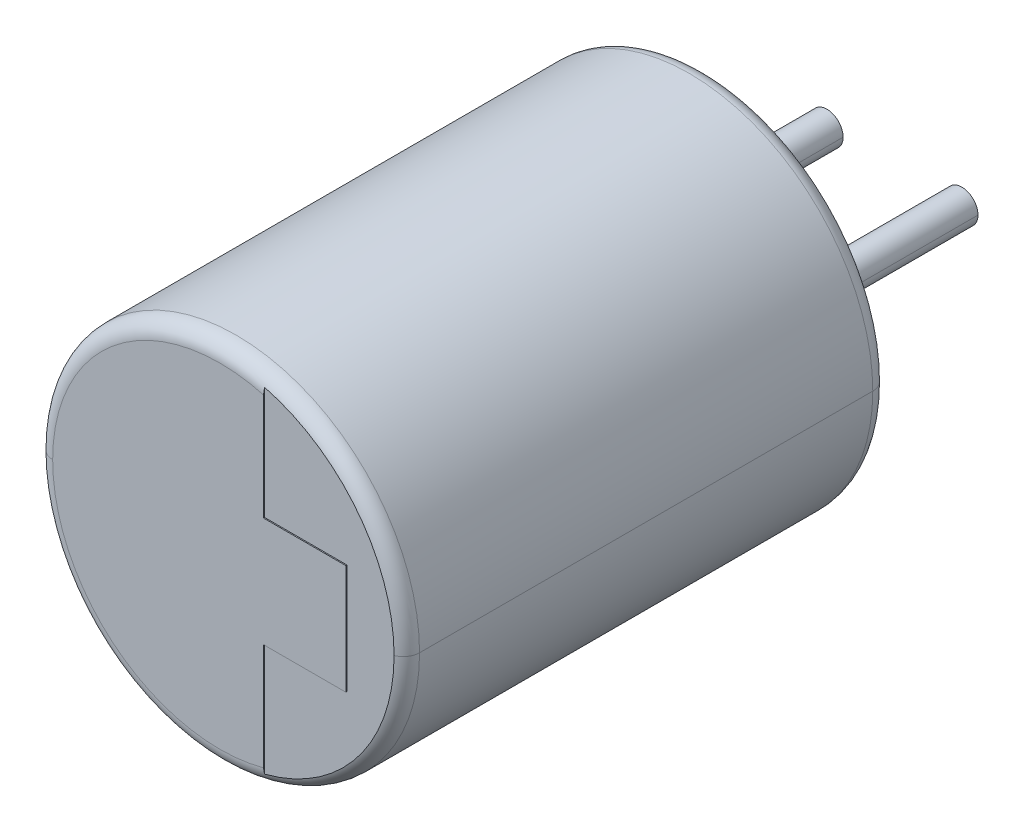
ISO-10303-21;
HEADER;
FILE_DESCRIPTION(('STEP AP214'),'2;1');
FILE_NAME('part.step','',(''),(''),'','','');
FILE_SCHEMA(('AUTOMOTIVE_DESIGN { 1 0 10303 214 1 1 1 1 }'));
ENDSEC;
DATA;
#1=APPLICATION_CONTEXT('core data for automotive mechanical design processes');
#2=APPLICATION_PROTOCOL_DEFINITION('international standard','automotive_design',2000,#1);
#3=PRODUCT_CONTEXT('',#1,'mechanical');
#4=PRODUCT('Part','Part','',(#3));
#5=PRODUCT_RELATED_PRODUCT_CATEGORY('part','',(#4));
#6=PRODUCT_DEFINITION_FORMATION('','',#4);
#7=PRODUCT_DEFINITION_CONTEXT('part definition',#1,'design');
#8=PRODUCT_DEFINITION('design','',#6,#7);
#9=PRODUCT_DEFINITION_SHAPE('','',#8);
#10=(LENGTH_UNIT() NAMED_UNIT(*) SI_UNIT(.MILLI.,.METRE.));
#11=(NAMED_UNIT(*) PLANE_ANGLE_UNIT() SI_UNIT($,.RADIAN.));
#12=(NAMED_UNIT(*) SI_UNIT($,.STERADIAN.) SOLID_ANGLE_UNIT());
#13=UNCERTAINTY_MEASURE_WITH_UNIT(LENGTH_MEASURE(1.E-05),#10,'distance_accuracy_value','');
#14=(GEOMETRIC_REPRESENTATION_CONTEXT(3) GLOBAL_UNCERTAINTY_ASSIGNED_CONTEXT((#13)) GLOBAL_UNIT_ASSIGNED_CONTEXT((#10,
#11,#12)) REPRESENTATION_CONTEXT('',''));
#15=CARTESIAN_POINT('',(0.,0.,0.));
#16=DIRECTION('',(0.,0.,1.));
#17=DIRECTION('',(1.,0.,0.));
#18=AXIS2_PLACEMENT_3D('',#15,#16,#17);
#19=CARTESIAN_POINT('',(1.25,0.,0.));
#20=DIRECTION('',(0.,0.,1.));
#21=DIRECTION('',(1.,0.,0.));
#22=AXIS2_PLACEMENT_3D('',#19,#20,#21);
#23=CYLINDRICAL_SURFACE('',#22,0.3);
#24=DIRECTION('',(0.,0.,-1.));
#25=VECTOR('',#24,1.);
#26=CARTESIAN_POINT('',(0.95,0.,0.));
#27=LINE('',#26,#25);
#28=CARTESIAN_POINT('',(0.95,0.,0.));
#29=VERTEX_POINT('',#28);
#30=CARTESIAN_POINT('',(0.95,0.,-3.5));
#31=VERTEX_POINT('',#30);
#32=EDGE_CURVE('E11',#29,#31,#27,.T.);
#33=ORIENTED_EDGE('',*,*,#32,.T.);
#34=CARTESIAN_POINT('',(1.25,0.,-3.5));
#35=DIRECTION('',(0.,0.,1.));
#36=DIRECTION('',(-1.,0.,0.));
#37=AXIS2_PLACEMENT_3D('',#34,#35,#36);
#38=CIRCLE('',#37,0.3);
#39=CARTESIAN_POINT('',(1.55,0.,-3.5));
#40=VERTEX_POINT('',#39);
#41=EDGE_CURVE('E208',#31,#40,#38,.T.);
#42=ORIENTED_EDGE('',*,*,#41,.T.);
#43=DIRECTION('',(0.,0.,-1.));
#44=VECTOR('',#43,1.);
#45=CARTESIAN_POINT('',(1.55,0.,0.));
#46=LINE('',#45,#44);
#47=CARTESIAN_POINT('',(1.55,0.,0.));
#48=VERTEX_POINT('',#47);
#49=EDGE_CURVE('E29',#48,#40,#46,.T.);
#50=ORIENTED_EDGE('',*,*,#49,.F.);
#51=CARTESIAN_POINT('',(1.25,0.,0.));
#52=DIRECTION('',(0.,0.,1.));
#53=DIRECTION('',(-1.,0.,0.));
#54=AXIS2_PLACEMENT_3D('',#51,#52,#53);
#55=CIRCLE('',#54,0.3);
#56=EDGE_CURVE('E179',#29,#48,#55,.T.);
#57=ORIENTED_EDGE('',*,*,#56,.F.);
#58=EDGE_LOOP('',(#33,#42,#50,#57));
#59=FACE_BOUND('',#58,.T.);
#60=ADVANCED_FACE('F18',(#59),#23,.T.);
#61=CARTESIAN_POINT('',(1.25,0.,0.));
#62=DIRECTION('',(0.,0.,1.));
#63=DIRECTION('',(1.,0.,0.));
#64=AXIS2_PLACEMENT_3D('',#61,#62,#63);
#65=CYLINDRICAL_SURFACE('',#64,0.3);
#66=ORIENTED_EDGE('',*,*,#49,.T.);
#67=CARTESIAN_POINT('',(1.25,0.,-3.5));
#68=DIRECTION('',(0.,0.,1.));
#69=DIRECTION('',(1.,0.,0.));
#70=AXIS2_PLACEMENT_3D('',#67,#68,#69);
#71=CIRCLE('',#70,0.3);
#72=EDGE_CURVE('E215',#40,#31,#71,.T.);
#73=ORIENTED_EDGE('',*,*,#72,.T.);
#74=ORIENTED_EDGE('',*,*,#32,.F.);
#75=CARTESIAN_POINT('',(1.25,0.,0.));
#76=DIRECTION('',(0.,0.,1.));
#77=DIRECTION('',(1.,0.,0.));
#78=AXIS2_PLACEMENT_3D('',#75,#76,#77);
#79=CIRCLE('',#78,0.3);
#80=EDGE_CURVE('E170',#48,#29,#79,.T.);
#81=ORIENTED_EDGE('',*,*,#80,.F.);
#82=EDGE_LOOP('',(#66,#73,#74,#81));
#83=FACE_BOUND('',#82,.T.);
#84=ADVANCED_FACE('F764',(#83),#65,.T.);
#85=CARTESIAN_POINT('',(0.,0.,-3.5));
#86=DIRECTION('',(0.,0.,1.));
#87=DIRECTION('',(1.,0.,0.));
#88=AXIS2_PLACEMENT_3D('',#85,#86,#87);
#89=PLANE('',#88);
#90=ORIENTED_EDGE('',*,*,#41,.F.);
#91=ORIENTED_EDGE('',*,*,#72,.F.);
#92=EDGE_LOOP('',(#90,#91));
#93=FACE_BOUND('',#92,.T.);
#94=ADVANCED_FACE('F778',(#93),#89,.F.);
#95=CARTESIAN_POINT('',(0.,0.,-3.5));
#96=DIRECTION('',(0.,0.,1.));
#97=DIRECTION('',(1.,0.,0.));
#98=AXIS2_PLACEMENT_3D('',#95,#96,#97);
#99=PLANE('',#98);
#100=CARTESIAN_POINT('',(-1.25,0.,-3.5));
#101=DIRECTION('',(0.,0.,1.));
#102=DIRECTION('',(-1.,0.,0.));
#103=AXIS2_PLACEMENT_3D('',#100,#101,#102);
#104=CIRCLE('',#103,0.3);
#105=CARTESIAN_POINT('',(-1.55,0.,-3.5));
#106=VERTEX_POINT('',#105);
#107=CARTESIAN_POINT('',(-0.95,0.,-3.5));
#108=VERTEX_POINT('',#107);
#109=EDGE_CURVE('E204',#106,#108,#104,.T.);
#110=ORIENTED_EDGE('',*,*,#109,.F.);
#111=CARTESIAN_POINT('',(-1.25,0.,-3.5));
#112=DIRECTION('',(0.,0.,1.));
#113=DIRECTION('',(1.,0.,0.));
#114=AXIS2_PLACEMENT_3D('',#111,#112,#113);
#115=CIRCLE('',#114,0.3);
#116=EDGE_CURVE('E195',#108,#106,#115,.T.);
#117=ORIENTED_EDGE('',*,*,#116,.F.);
#118=EDGE_LOOP('',(#110,#117));
#119=FACE_BOUND('',#118,.T.);
#120=ADVANCED_FACE('F789',(#119),#99,.F.);
#121=CARTESIAN_POINT('',(-1.25,0.,0.));
#122=DIRECTION('',(0.,0.,1.));
#123=DIRECTION('',(1.,0.,0.));
#124=AXIS2_PLACEMENT_3D('',#121,#122,#123);
#125=CYLINDRICAL_SURFACE('',#124,0.3);
#126=DIRECTION('',(0.,0.,-1.));
#127=VECTOR('',#126,1.);
#128=CARTESIAN_POINT('',(-1.55,0.,0.));
#129=LINE('',#128,#127);
#130=CARTESIAN_POINT('',(-1.55,0.,0.));
#131=VERTEX_POINT('',#130);
#132=EDGE_CURVE('E199',#131,#106,#129,.T.);
#133=ORIENTED_EDGE('',*,*,#132,.T.);
#134=ORIENTED_EDGE('',*,*,#109,.T.);
#135=DIRECTION('',(0.,0.,-1.));
#136=VECTOR('',#135,1.);
#137=CARTESIAN_POINT('',(-0.95,0.,0.));
#138=LINE('',#137,#136);
#139=CARTESIAN_POINT('',(-0.95,0.,0.));
#140=VERTEX_POINT('',#139);
#141=EDGE_CURVE('E200',#140,#108,#138,.T.);
#142=ORIENTED_EDGE('',*,*,#141,.F.);
#143=CARTESIAN_POINT('',(-1.25,0.,0.));
#144=DIRECTION('',(0.,0.,1.));
#145=DIRECTION('',(-1.,0.,0.));
#146=AXIS2_PLACEMENT_3D('',#143,#144,#145);
#147=CIRCLE('',#146,0.3);
#148=EDGE_CURVE('E279',#131,#140,#147,.T.);
#149=ORIENTED_EDGE('',*,*,#148,.F.);
#150=EDGE_LOOP('',(#133,#134,#142,#149));
#151=FACE_BOUND('',#150,.T.);
#152=ADVANCED_FACE('F801',(#151),#125,.T.);
#153=CARTESIAN_POINT('',(-1.25,0.,0.));
#154=DIRECTION('',(0.,0.,1.));
#155=DIRECTION('',(1.,0.,0.));
#156=AXIS2_PLACEMENT_3D('',#153,#154,#155);
#157=CYLINDRICAL_SURFACE('',#156,0.3);
#158=ORIENTED_EDGE('',*,*,#141,.T.);
#159=ORIENTED_EDGE('',*,*,#116,.T.);
#160=ORIENTED_EDGE('',*,*,#132,.F.);
#161=CARTESIAN_POINT('',(-1.25,0.,0.));
#162=DIRECTION('',(0.,0.,1.));
#163=DIRECTION('',(1.,0.,0.));
#164=AXIS2_PLACEMENT_3D('',#161,#162,#163);
#165=CIRCLE('',#164,0.3);
#166=EDGE_CURVE('E282',#140,#131,#165,.T.);
#167=ORIENTED_EDGE('',*,*,#166,.F.);
#168=EDGE_LOOP('',(#158,#159,#160,#167));
#169=FACE_BOUND('',#168,.T.);
#170=ADVANCED_FACE('F813',(#169),#157,.T.);
#171=CARTESIAN_POINT('',(2.334429515751,-1.016,9.));
#172=DIRECTION('',(0.,1.,0.));
#173=DIRECTION('',(1.,0.,0.));
#174=AXIS2_PLACEMENT_3D('',#171,#172,#173);
#175=PLANE('',#174);
#176=DIRECTION('',(0.,0.,-1.));
#177=VECTOR('',#176,1.);
#178=CARTESIAN_POINT('',(0.8104295157508,-1.016,9.));
#179=LINE('',#178,#177);
#180=CARTESIAN_POINT('',(0.8104295157508,-1.016,9.));
#181=VERTEX_POINT('',#180);
#182=CARTESIAN_POINT('',(0.8104295157508,-1.016,8.98));
#183=VERTEX_POINT('',#182);
#184=EDGE_CURVE('E254',#181,#183,#179,.T.);
#185=ORIENTED_EDGE('',*,*,#184,.T.);
#186=DIRECTION('',(-1.,0.,0.));
#187=VECTOR('',#186,1.);
#188=CARTESIAN_POINT('',(2.334429515751,-1.016,8.98));
#189=LINE('',#188,#187);
#190=CARTESIAN_POINT('',(2.334429515751,-1.016,8.98));
#191=VERTEX_POINT('',#190);
#192=EDGE_CURVE('E193',#191,#183,#189,.T.);
#193=ORIENTED_EDGE('',*,*,#192,.F.);
#194=DIRECTION('',(0.,0.,-1.));
#195=VECTOR('',#194,1.);
#196=CARTESIAN_POINT('',(2.334429515751,-1.016,9.));
#197=LINE('',#196,#195);
#198=CARTESIAN_POINT('',(2.334429515751,-1.016,9.));
#199=VERTEX_POINT('',#198);
#200=EDGE_CURVE('E22',#199,#191,#197,.T.);
#201=ORIENTED_EDGE('',*,*,#200,.F.);
#202=DIRECTION('',(-1.,0.,0.));
#203=VECTOR('',#202,1.);
#204=CARTESIAN_POINT('',(2.334429515751,-1.016,9.));
#205=LINE('',#204,#203);
#206=EDGE_CURVE('E229',#199,#181,#205,.T.);
#207=ORIENTED_EDGE('',*,*,#206,.T.);
#208=EDGE_LOOP('',(#185,#193,#201,#207));
#209=FACE_BOUND('',#208,.T.);
#210=ADVANCED_FACE('F363',(#209),#175,.F.);
#211=CARTESIAN_POINT('',(2.334429515751,1.016,9.));
#212=DIRECTION('',(-1.,0.,0.));
#213=DIRECTION('',(0.,0.,1.));
#214=AXIS2_PLACEMENT_3D('',#211,#212,#213);
#215=PLANE('',#214);
#216=ORIENTED_EDGE('',*,*,#200,.T.);
#217=DIRECTION('',(0.,-1.,0.));
#218=VECTOR('',#217,1.);
#219=CARTESIAN_POINT('',(2.334429515751,1.016,8.98));
#220=LINE('',#219,#218);
#221=CARTESIAN_POINT('',(2.334429515751,1.016,8.98));
#222=VERTEX_POINT('',#221);
#223=EDGE_CURVE('E189',#222,#191,#220,.T.);
#224=ORIENTED_EDGE('',*,*,#223,.F.);
#225=DIRECTION('',(0.,0.,-1.));
#226=VECTOR('',#225,1.);
#227=CARTESIAN_POINT('',(2.334429515751,1.016,9.));
#228=LINE('',#227,#226);
#229=CARTESIAN_POINT('',(2.334429515751,1.016,9.));
#230=VERTEX_POINT('',#229);
#231=EDGE_CURVE('E278',#230,#222,#228,.T.);
#232=ORIENTED_EDGE('',*,*,#231,.F.);
#233=DIRECTION('',(0.,-1.,0.));
#234=VECTOR('',#233,1.);
#235=CARTESIAN_POINT('',(2.334429515751,1.016,9.));
#236=LINE('',#235,#234);
#237=EDGE_CURVE('E233',#230,#199,#236,.T.);
#238=ORIENTED_EDGE('',*,*,#237,.T.);
#239=EDGE_LOOP('',(#216,#224,#232,#238));
#240=FACE_BOUND('',#239,.T.);
#241=ADVANCED_FACE('F390',(#240),#215,.F.);
#242=CARTESIAN_POINT('',(0.8104295157508,1.016,9.));
#243=DIRECTION('',(0.,-1.,0.));
#244=DIRECTION('',(0.,0.,-1.));
#245=AXIS2_PLACEMENT_3D('',#242,#243,#244);
#246=PLANE('',#245);
#247=ORIENTED_EDGE('',*,*,#231,.T.);
#248=DIRECTION('',(1.,0.,0.));
#249=VECTOR('',#248,1.);
#250=CARTESIAN_POINT('',(0.8104295157508,1.016,8.98));
#251=LINE('',#250,#249);
#252=CARTESIAN_POINT('',(0.8104295157508,1.016,8.98));
#253=VERTEX_POINT('',#252);
#254=EDGE_CURVE('E194',#253,#222,#251,.T.);
#255=ORIENTED_EDGE('',*,*,#254,.F.);
#256=DIRECTION('',(0.,0.,-1.));
#257=VECTOR('',#256,1.);
#258=CARTESIAN_POINT('',(0.8104295157508,1.016,9.));
#259=LINE('',#258,#257);
#260=CARTESIAN_POINT('',(0.8104295157508,1.016,9.));
#261=VERTEX_POINT('',#260);
#262=EDGE_CURVE('E242',#261,#253,#259,.T.);
#263=ORIENTED_EDGE('',*,*,#262,.F.);
#264=DIRECTION('',(1.,0.,0.));
#265=VECTOR('',#264,1.);
#266=CARTESIAN_POINT('',(0.8104295157508,1.016,9.));
#267=LINE('',#266,#265);
#268=EDGE_CURVE('E237',#261,#230,#267,.T.);
#269=ORIENTED_EDGE('',*,*,#268,.T.);
#270=EDGE_LOOP('',(#247,#255,#263,#269));
#271=FACE_BOUND('',#270,.T.);
#272=ADVANCED_FACE('F387',(#271),#246,.F.);
#273=CARTESIAN_POINT('',(0.,0.,0.));
#274=DIRECTION('',(0.,0.,1.));
#275=DIRECTION('',(1.,0.,0.));
#276=AXIS2_PLACEMENT_3D('',#273,#274,#275);
#277=CYLINDRICAL_SURFACE('',#276,3.4);
#278=DIRECTION('',(0.,-1.959870964262E-13,1.));
#279=VECTOR('',#278,1.);
#280=CARTESIAN_POINT('',(3.4,1.262778909203E-12,0.3));
#281=LINE('',#280,#279);
#282=CARTESIAN_POINT('',(3.4,1.262778909203E-12,0.3));
#283=VERTEX_POINT('',#282);
#284=CARTESIAN_POINT('',(3.4,0.,8.7));
#285=VERTEX_POINT('',#284);
#286=EDGE_CURVE('E148',#283,#285,#281,.T.);
#287=ORIENTED_EDGE('',*,*,#286,.F.);
#288=CARTESIAN_POINT('',(0.,0.,0.3));
#289=DIRECTION('',(0.,0.,-1.));
#290=DIRECTION('',(-1.,0.,0.));
#291=AXIS2_PLACEMENT_3D('',#288,#289,#290);
#292=CIRCLE('',#291,3.4);
#293=CARTESIAN_POINT('',(-3.4,-1.262878667372E-12,0.3));
#294=VERTEX_POINT('',#293);
#295=EDGE_CURVE('E160',#294,#283,#292,.T.);
#296=ORIENTED_EDGE('',*,*,#295,.F.);
#297=DIRECTION('',(0.,1.960186931752E-13,1.));
#298=VECTOR('',#297,1.);
#299=CARTESIAN_POINT('',(-3.4,-1.262878667372E-12,0.3));
#300=LINE('',#299,#298);
#301=CARTESIAN_POINT('',(-3.4,0.,8.7));
#302=VERTEX_POINT('',#301);
#303=EDGE_CURVE('E138',#294,#302,#300,.T.);
#304=ORIENTED_EDGE('',*,*,#303,.T.);
#305=CARTESIAN_POINT('',(0.,0.,8.7));
#306=DIRECTION('',(0.,0.,1.));
#307=DIRECTION('',(1.,0.,0.));
#308=AXIS2_PLACEMENT_3D('',#305,#306,#307);
#309=CIRCLE('',#308,3.4);
#310=EDGE_CURVE('E275',#285,#302,#309,.T.);
#311=ORIENTED_EDGE('',*,*,#310,.F.);
#312=EDGE_LOOP('',(#287,#296,#304,#311));
#313=FACE_BOUND('',#312,.T.);
#314=ADVANCED_FACE('F161',(#313),#277,.T.);
#315=CARTESIAN_POINT('',(0.,0.,8.7));
#316=DIRECTION('',(0.,0.,1.));
#317=DIRECTION('',(0.999982252049581,-0.00595781720508788,0.));
#318=AXIS2_PLACEMENT_3D('',#315,#316,#317);
#319=TOROIDAL_SURFACE('',#318,3.1,0.3);
#320=CARTESIAN_POINT('',(0.,0.,8.98));
#321=DIRECTION('',(0.,0.,1.));
#322=DIRECTION('',(1.,1.16122655207E-11,0.));
#323=AXIS2_PLACEMENT_3D('',#320,#321,#322);
#324=CIRCLE('',#323,3.207703296142);
#325=CARTESIAN_POINT('',(3.207703296142,3.724887065459E-11,8.98));
#326=VERTEX_POINT('',#325);
#327=CARTESIAN_POINT('',(0.8104295157508,3.103637291322,8.98));
#328=VERTEX_POINT('',#327);
#329=EDGE_CURVE('E184',#326,#328,#324,.T.);
#330=ORIENTED_EDGE('',*,*,#329,.F.);
#331=CARTESIAN_POINT('',(3.1,3.599802053667E-11,8.7));
#332=DIRECTION('',(-1.16122649690402E-11,1.,0.));
#333=DIRECTION('',(0.359010987141394,4.16893070948292E-12,0.933333333333682));
#334=AXIS2_PLACEMENT_3D('',#331,#332,#333);
#335=CIRCLE('',#334,0.3);
#336=EDGE_CURVE('E251',#326,#285,#335,.T.);
#337=ORIENTED_EDGE('',*,*,#336,.T.);
#338=ORIENTED_EDGE('',*,*,#310,.T.);
#339=CARTESIAN_POINT('',(-3.1,0.,8.7));
#340=DIRECTION('',(0.,-1.,0.));
#341=DIRECTION('',(0.,0.,1.));
#342=AXIS2_PLACEMENT_3D('',#339,#340,#341);
#343=CIRCLE('',#342,0.3);
#344=CARTESIAN_POINT('',(-3.1,0.,9.));
#345=VERTEX_POINT('',#344);
#346=EDGE_CURVE('E273',#345,#302,#343,.T.);
#347=ORIENTED_EDGE('',*,*,#346,.F.);
#348=CARTESIAN_POINT('',(0.,0.,9.));
#349=DIRECTION('',(0.,0.,1.));
#350=DIRECTION('',(0.261428876048598,0.965222742566692,0.));
#351=AXIS2_PLACEMENT_3D('',#348,#349,#350);
#352=CIRCLE('',#351,3.1);
#353=CARTESIAN_POINT('',(0.8104295157508,2.992190501957,9.));
#354=VERTEX_POINT('',#353);
#355=EDGE_CURVE('E226',#354,#345,#352,.T.);
#356=ORIENTED_EDGE('',*,*,#355,.F.);
#357=CARTESIAN_POINT('',(0.8104295157508,2.992190501957,9.));
#358=CARTESIAN_POINT('',(0.8104295157508,3.011480288019,9.));
#359=CARTESIAN_POINT('',(0.8104295157508,3.049341387327,8.996561869235));
#360=CARTESIAN_POINT('',(0.8104295157508,3.085784218799,8.986644475486));
#361=CARTESIAN_POINT('',(0.8104295157508,3.103637291322,8.98));
#362=(BOUNDED_CURVE() B_SPLINE_CURVE(3,(#357,#358,#359,#360,#361),.UNSPECIFIED.,.F.,
.F.) B_SPLINE_CURVE_WITH_KNOTS((4,1,4),(0.,0.5,1.),
.UNSPECIFIED.) CURVE() GEOMETRIC_REPRESENTATION_ITEM() RATIONAL_B_SPLINE_CURVE((1.,1.,1.,1.,1.)) REPRESENTATION_ITEM(''));
#363=EDGE_CURVE('E245',#354,#328,#362,.T.);
#364=ORIENTED_EDGE('',*,*,#363,.T.);
#365=EDGE_LOOP('',(#330,#337,#338,#347,#356,#364));
#366=FACE_BOUND('',#365,.T.);
#367=ADVANCED_FACE('F375',(#366),#319,.T.);
#368=CARTESIAN_POINT('',(0.8104295157508,3.302,9.));
#369=DIRECTION('',(-1.,0.,0.));
#370=DIRECTION('',(0.,0.,1.));
#371=AXIS2_PLACEMENT_3D('',#368,#369,#370);
#372=PLANE('',#371);
#373=ORIENTED_EDGE('',*,*,#262,.T.);
#374=DIRECTION('',(0.,-1.,0.));
#375=VECTOR('',#374,1.);
#376=CARTESIAN_POINT('',(0.8104295157508,3.103637291322,8.98));
#377=LINE('',#376,#375);
#378=EDGE_CURVE('E187',#328,#253,#377,.T.);
#379=ORIENTED_EDGE('',*,*,#378,.F.);
#380=ORIENTED_EDGE('',*,*,#363,.F.);
#381=DIRECTION('',(0.,-1.,0.));
#382=VECTOR('',#381,1.);
#383=CARTESIAN_POINT('',(0.8104295157508,2.992190501957,9.));
#384=LINE('',#383,#382);
#385=EDGE_CURVE('E241',#354,#261,#384,.T.);
#386=ORIENTED_EDGE('',*,*,#385,.T.);
#387=EDGE_LOOP('',(#373,#379,#380,#386));
#388=FACE_BOUND('',#387,.T.);
#389=ADVANCED_FACE('F343',(#388),#372,.F.);
#390=CARTESIAN_POINT('',(0.,0.,9.));
#391=DIRECTION('',(0.,0.,1.));
#392=DIRECTION('',(1.,0.,0.));
#393=AXIS2_PLACEMENT_3D('',#390,#391,#392);
#394=PLANE('',#393);
#395=ORIENTED_EDGE('',*,*,#355,.T.);
#396=CARTESIAN_POINT('',(0.,0.,9.));
#397=DIRECTION('',(0.,0.,1.));
#398=DIRECTION('',(-1.,0.,0.));
#399=AXIS2_PLACEMENT_3D('',#396,#397,#398);
#400=CIRCLE('',#399,3.1);
#401=CARTESIAN_POINT('',(0.8104295157508,-2.992190501957,9.));
#402=VERTEX_POINT('',#401);
#403=EDGE_CURVE('E309',#345,#402,#400,.T.);
#404=ORIENTED_EDGE('',*,*,#403,.T.);
#405=DIRECTION('',(0.,-1.,0.));
#406=VECTOR('',#405,1.);
#407=CARTESIAN_POINT('',(0.8104295157508,-1.016,9.));
#408=LINE('',#407,#406);
#409=EDGE_CURVE('E230',#181,#402,#408,.T.);
#410=ORIENTED_EDGE('',*,*,#409,.F.);
#411=ORIENTED_EDGE('',*,*,#206,.F.);
#412=ORIENTED_EDGE('',*,*,#237,.F.);
#413=ORIENTED_EDGE('',*,*,#268,.F.);
#414=ORIENTED_EDGE('',*,*,#385,.F.);
#415=EDGE_LOOP('',(#395,#404,#410,#411,#412,#413,#414));
#416=FACE_BOUND('',#415,.T.);
#417=ADVANCED_FACE('F383',(#416),#394,.T.);
#418=CARTESIAN_POINT('',(0.8104295157508,-1.016,9.));
#419=DIRECTION('',(-1.,0.,0.));
#420=DIRECTION('',(0.,0.,1.));
#421=AXIS2_PLACEMENT_3D('',#418,#419,#420);
#422=PLANE('',#421);
#423=CARTESIAN_POINT('',(0.8104295157508,-3.103637291322,8.98));
#424=CARTESIAN_POINT('',(0.8104295157508,-3.085784218799,8.986644475486));
#425=CARTESIAN_POINT('',(0.8104295157508,-3.049341387327,8.996561869235));
#426=CARTESIAN_POINT('',(0.8104295157508,-3.011480288019,9.));
#427=CARTESIAN_POINT('',(0.8104295157508,-2.992190501957,9.));
#428=(BOUNDED_CURVE() B_SPLINE_CURVE(3,(#423,#424,#425,#426,#427),.UNSPECIFIED.,.F.,
.F.) B_SPLINE_CURVE_WITH_KNOTS((4,1,4),(0.,0.5,1.),
.UNSPECIFIED.) CURVE() GEOMETRIC_REPRESENTATION_ITEM() RATIONAL_B_SPLINE_CURVE((1.,1.,1.,1.,1.)) REPRESENTATION_ITEM(''));
#429=CARTESIAN_POINT('',(0.8104295157508,-3.103637291322,8.98));
#430=VERTEX_POINT('',#429);
#431=EDGE_CURVE('E247',#430,#402,#428,.T.);
#432=ORIENTED_EDGE('',*,*,#431,.F.);
#433=DIRECTION('',(0.,-1.,0.));
#434=VECTOR('',#433,1.);
#435=CARTESIAN_POINT('',(0.8104295157508,-1.016,8.98));
#436=LINE('',#435,#434);
#437=EDGE_CURVE('E252',#183,#430,#436,.T.);
#438=ORIENTED_EDGE('',*,*,#437,.F.);
#439=ORIENTED_EDGE('',*,*,#184,.F.);
#440=ORIENTED_EDGE('',*,*,#409,.T.);
#441=EDGE_LOOP('',(#432,#438,#439,#440));
#442=FACE_BOUND('',#441,.T.);
#443=ADVANCED_FACE('F368',(#442),#422,.F.);
#444=CARTESIAN_POINT('',(0.,0.,8.98));
#445=DIRECTION('',(0.,0.,1.));
#446=DIRECTION('',(1.,0.,0.));
#447=AXIS2_PLACEMENT_3D('',#444,#445,#446);
#448=PLANE('',#447);
#449=ORIENTED_EDGE('',*,*,#329,.T.);
#450=ORIENTED_EDGE('',*,*,#378,.T.);
#451=ORIENTED_EDGE('',*,*,#254,.T.);
#452=ORIENTED_EDGE('',*,*,#223,.T.);
#453=ORIENTED_EDGE('',*,*,#192,.T.);
#454=ORIENTED_EDGE('',*,*,#437,.T.);
#455=CARTESIAN_POINT('',(0.,0.,8.98));
#456=DIRECTION('',(0.,0.,1.));
#457=DIRECTION('',(0.252651021908803,-0.967557471744411,0.));
#458=AXIS2_PLACEMENT_3D('',#455,#456,#457);
#459=CIRCLE('',#458,3.207703296142);
#460=EDGE_CURVE('E188',#430,#326,#459,.T.);
#461=ORIENTED_EDGE('',*,*,#460,.T.);
#462=EDGE_LOOP('',(#449,#450,#451,#452,#453,#454,#461));
#463=FACE_BOUND('',#462,.T.);
#464=ADVANCED_FACE('F339',(#463),#448,.T.);
#465=CARTESIAN_POINT('',(0.,0.,8.7));
#466=DIRECTION('',(0.,0.,1.));
#467=DIRECTION('',(-0.999982252049581,0.00595781720508788,0.));
#468=AXIS2_PLACEMENT_3D('',#465,#466,#467);
#469=TOROIDAL_SURFACE('',#468,3.1,0.3);
#470=ORIENTED_EDGE('',*,*,#431,.T.);
#471=ORIENTED_EDGE('',*,*,#403,.F.);
#472=ORIENTED_EDGE('',*,*,#346,.T.);
#473=CARTESIAN_POINT('',(0.,0.,8.7));
#474=DIRECTION('',(0.,0.,1.));
#475=DIRECTION('',(-1.,0.,0.));
#476=AXIS2_PLACEMENT_3D('',#473,#474,#475);
#477=CIRCLE('',#476,3.4);
#478=EDGE_CURVE('E144',#302,#285,#477,.T.);
#479=ORIENTED_EDGE('',*,*,#478,.T.);
#480=ORIENTED_EDGE('',*,*,#336,.F.);
#481=ORIENTED_EDGE('',*,*,#460,.F.);
#482=EDGE_LOOP('',(#470,#471,#472,#479,#480,#481));
#483=FACE_BOUND('',#482,.T.);
#484=ADVANCED_FACE('F372',(#483),#469,.T.);
#485=CARTESIAN_POINT('',(0.,0.,0.));
#486=DIRECTION('',(0.,0.,1.));
#487=DIRECTION('',(1.,0.,0.));
#488=AXIS2_PLACEMENT_3D('',#485,#486,#487);
#489=CYLINDRICAL_SURFACE('',#488,3.4);
#490=ORIENTED_EDGE('',*,*,#303,.F.);
#491=CARTESIAN_POINT('',(0.,0.,0.3));
#492=DIRECTION('',(0.,0.,-1.));
#493=DIRECTION('',(1.,0.,0.));
#494=AXIS2_PLACEMENT_3D('',#491,#492,#493);
#495=CIRCLE('',#494,3.4);
#496=EDGE_CURVE('E141',#283,#294,#495,.T.);
#497=ORIENTED_EDGE('',*,*,#496,.F.);
#498=ORIENTED_EDGE('',*,*,#286,.T.);
#499=ORIENTED_EDGE('',*,*,#478,.F.);
#500=EDGE_LOOP('',(#490,#497,#498,#499));
#501=FACE_BOUND('',#500,.T.);
#502=ADVANCED_FACE('F20',(#501),#489,.T.);
#503=CARTESIAN_POINT('',(0.,0.,0.3));
#504=DIRECTION('',(0.,0.,1.));
#505=DIRECTION('',(0.999964185128448,0.0084633598765374,0.));
#506=AXIS2_PLACEMENT_3D('',#503,#504,#505);
#507=TOROIDAL_SURFACE('',#506,3.1,0.3);
#508=CARTESIAN_POINT('',(3.1,0.,0.3));
#509=DIRECTION('',(0.,-1.,0.));
#510=DIRECTION('',(0.,0.,-1.));
#511=AXIS2_PLACEMENT_3D('',#508,#509,#510);
#512=CIRCLE('',#511,0.3);
#513=CARTESIAN_POINT('',(3.1,0.,0.));
#514=VERTEX_POINT('',#513);
#515=EDGE_CURVE('E156',#514,#283,#512,.T.);
#516=ORIENTED_EDGE('',*,*,#515,.T.);
#517=ORIENTED_EDGE('',*,*,#496,.T.);
#518=CARTESIAN_POINT('',(-3.1,0.,0.3));
#519=DIRECTION('',(0.,1.,0.));
#520=DIRECTION('',(0.,0.,-1.));
#521=AXIS2_PLACEMENT_3D('',#518,#519,#520);
#522=CIRCLE('',#521,0.3);
#523=CARTESIAN_POINT('',(-3.1,0.,0.));
#524=VERTEX_POINT('',#523);
#525=EDGE_CURVE('E154',#524,#294,#522,.T.);
#526=ORIENTED_EDGE('',*,*,#525,.F.);
#527=CARTESIAN_POINT('',(0.,0.,0.));
#528=DIRECTION('',(0.,0.,-1.));
#529=DIRECTION('',(1.,0.,0.));
#530=AXIS2_PLACEMENT_3D('',#527,#528,#529);
#531=CIRCLE('',#530,3.1);
#532=EDGE_CURVE('E290',#514,#524,#531,.T.);
#533=ORIENTED_EDGE('',*,*,#532,.F.);
#534=EDGE_LOOP('',(#516,#517,#526,#533));
#535=FACE_BOUND('',#534,.T.);
#536=ADVANCED_FACE('F151',(#535),#507,.T.);
#537=CARTESIAN_POINT('',(0.,0.,0.3));
#538=DIRECTION('',(0.,0.,1.));
#539=DIRECTION('',(-0.999964185128448,-0.0084633598765374,0.));
#540=AXIS2_PLACEMENT_3D('',#537,#538,#539);
#541=TOROIDAL_SURFACE('',#540,3.1,0.3);
#542=ORIENTED_EDGE('',*,*,#525,.T.);
#543=ORIENTED_EDGE('',*,*,#295,.T.);
#544=ORIENTED_EDGE('',*,*,#515,.F.);
#545=CARTESIAN_POINT('',(0.,0.,0.));
#546=DIRECTION('',(0.,0.,-1.));
#547=DIRECTION('',(-1.,0.,0.));
#548=AXIS2_PLACEMENT_3D('',#545,#546,#547);
#549=CIRCLE('',#548,3.1);
#550=EDGE_CURVE('E167',#524,#514,#549,.T.);
#551=ORIENTED_EDGE('',*,*,#550,.F.);
#552=EDGE_LOOP('',(#542,#543,#544,#551));
#553=FACE_BOUND('',#552,.T.);
#554=ADVANCED_FACE('F165',(#553),#541,.T.);
#555=CARTESIAN_POINT('',(0.,0.,0.));
#556=DIRECTION('',(0.,0.,1.));
#557=DIRECTION('',(1.,0.,0.));
#558=AXIS2_PLACEMENT_3D('',#555,#556,#557);
#559=PLANE('',#558);
#560=ORIENTED_EDGE('',*,*,#56,.T.);
#561=ORIENTED_EDGE('',*,*,#80,.T.);
#562=EDGE_LOOP('',(#560,#561));
#563=FACE_BOUND('',#562,.T.);
#564=ORIENTED_EDGE('',*,*,#148,.T.);
#565=ORIENTED_EDGE('',*,*,#166,.T.);
#566=EDGE_LOOP('',(#564,#565));
#567=FACE_BOUND('',#566,.T.);
#568=ORIENTED_EDGE('',*,*,#532,.T.);
#569=ORIENTED_EDGE('',*,*,#550,.T.);
#570=EDGE_LOOP('',(#568,#569));
#571=FACE_BOUND('',#570,.T.);
#572=ADVANCED_FACE('F710',(#563,#567,#571),#559,.F.);
#573=CLOSED_SHELL('',(#60,#84,#94,#120,#152,#170,#210,#241,#272,#314,#367,#389,#417,#443,#464,
#484,#502,#536,#554,#572));
#574=MANIFOLD_SOLID_BREP('B1',#573);
#575=ADVANCED_BREP_SHAPE_REPRESENTATION('',(#18,#574),#14);
#576=SHAPE_DEFINITION_REPRESENTATION(#9,#575);
ENDSEC;
END-ISO-10303-21;
